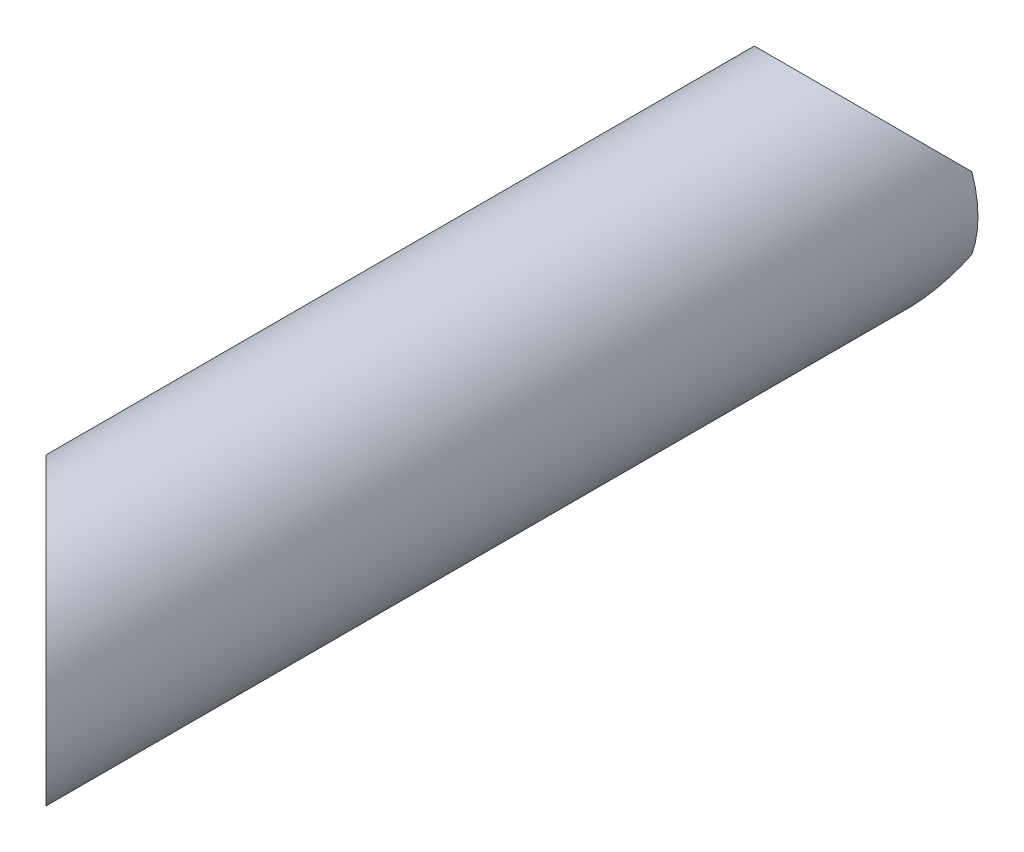
ISO-10303-21;
HEADER;
FILE_DESCRIPTION(('STEP AP214'),'2;1');
FILE_NAME('part.step','',(''),(''),'','','');
FILE_SCHEMA(('AUTOMOTIVE_DESIGN { 1 0 10303 214 1 1 1 1 }'));
ENDSEC;
DATA;
#1=APPLICATION_CONTEXT('core data for automotive mechanical design processes');
#2=APPLICATION_PROTOCOL_DEFINITION('international standard','automotive_design',2000,#1);
#3=PRODUCT_CONTEXT('',#1,'mechanical');
#4=PRODUCT('Part','Part','',(#3));
#5=PRODUCT_RELATED_PRODUCT_CATEGORY('part','',(#4));
#6=PRODUCT_DEFINITION_FORMATION('','',#4);
#7=PRODUCT_DEFINITION_CONTEXT('part definition',#1,'design');
#8=PRODUCT_DEFINITION('design','',#6,#7);
#9=PRODUCT_DEFINITION_SHAPE('','',#8);
#10=(LENGTH_UNIT() NAMED_UNIT(*) SI_UNIT(.MILLI.,.METRE.));
#11=(NAMED_UNIT(*) PLANE_ANGLE_UNIT() SI_UNIT($,.RADIAN.));
#12=(NAMED_UNIT(*) SI_UNIT($,.STERADIAN.) SOLID_ANGLE_UNIT());
#13=UNCERTAINTY_MEASURE_WITH_UNIT(LENGTH_MEASURE(1.E-05),#10,'distance_accuracy_value','');
#14=(GEOMETRIC_REPRESENTATION_CONTEXT(3) GLOBAL_UNCERTAINTY_ASSIGNED_CONTEXT((#13)) GLOBAL_UNIT_ASSIGNED_CONTEXT((#10,
#11,#12)) REPRESENTATION_CONTEXT('',''));
#15=CARTESIAN_POINT('',(0.,0.,0.));
#16=DIRECTION('',(0.,0.,1.));
#17=DIRECTION('',(1.,0.,0.));
#18=AXIS2_PLACEMENT_3D('',#15,#16,#17);
#19=CARTESIAN_POINT('',(0.,0.,0.));
#20=DIRECTION('',(0.,0.,1.));
#21=DIRECTION('',(1.,0.,0.));
#22=AXIS2_PLACEMENT_3D('',#19,#20,#21);
#23=CYLINDRICAL_SURFACE('',#22,16.9418);
#24=CARTESIAN_POINT('',(-16.9418,0.,2.36079288928395));
#25=CARTESIAN_POINT('',(-16.9417971911458,0.26204091353557,2.36080220963783));
#26=CARTESIAN_POINT('',(-16.9356999168505,0.52414580531681,2.37268877904648));
#27=CARTESIAN_POINT('',(-16.9115084687074,1.04583304330237,2.41949474543712));
#28=CARTESIAN_POINT('',(-16.8934062218583,1.30541357267499,2.4544296416793));
#29=CARTESIAN_POINT('',(-16.8456934408202,1.82052686027869,2.54537696237387));
#30=CARTESIAN_POINT('',(-16.8160488500434,2.07604528892248,2.60145174602307));
#31=CARTESIAN_POINT('',(-16.745998056192,2.58092330513842,2.73182326173861));
#32=CARTESIAN_POINT('',(-16.705586602921,2.83027982300868,2.80612888222278));
#33=CARTESIAN_POINT('',(-16.5937130134028,3.43617555401542,3.00787884050468));
#34=CARTESIAN_POINT('',(-16.5165432443815,3.7887724808199,3.14398316469817));
#35=CARTESIAN_POINT('',(-16.3429040786453,4.47894007056581,3.43986296991705));
#36=CARTESIAN_POINT('',(-16.2464220519613,4.81650072242727,3.59965392385975));
#37=CARTESIAN_POINT('',(-16.0353519528832,5.47842118478502,3.936379966143));
#38=CARTESIAN_POINT('',(-15.9207079647238,5.80273620412053,4.11336732455479));
#39=CARTESIAN_POINT('',(-15.6745245861669,6.43816364109246,4.47868001881189));
#40=CARTESIAN_POINT('',(-15.5429871440198,6.74927757565824,4.66700404591887));
#41=CARTESIAN_POINT('',(-15.2876265840934,7.30685828978258,5.01792193937438));
#42=CARTESIAN_POINT('',(-15.1663719794524,7.55523589780271,5.17936588077027));
#43=CARTESIAN_POINT('',(-14.9128296233513,8.04412241901906,5.50549313003114));
#44=CARTESIAN_POINT('',(-14.7805406669795,8.28463046888476,5.67017679015756));
#45=CARTESIAN_POINT('',(-14.3671286777155,8.99504328917724,6.16692838824692));
#46=CARTESIAN_POINT('',(-14.0695301372154,9.45368541428674,6.50159952883297));
#47=CARTESIAN_POINT('',(-13.4308460876238,10.3409516657073,7.16768766252836));
#48=CARTESIAN_POINT('',(-13.0898096922269,10.7696088598247,7.49910788245544));
#49=CARTESIAN_POINT('',(-12.3634321570896,11.5962318020435,8.1512444873396));
#50=CARTESIAN_POINT('',(-11.978112208146,11.9942120787523,8.47196589792548));
#51=CARTESIAN_POINT('',(-11.2593970550385,12.6661635149107,9.02145985247217));
#52=CARTESIAN_POINT('',(-10.935395194055,12.9471427198031,9.25398369778406));
#53=CARTESIAN_POINT('',(-10.2611018317362,13.4878126007023,9.70543060253195));
#54=CARTESIAN_POINT('',(-9.91081089326416,13.7475037322491,9.92435395297853));
#55=CARTESIAN_POINT('',(-9.1846650047165,14.2428722848722,10.3449165959115));
#56=CARTESIAN_POINT('',(-8.80884614161041,14.478582474584,10.5465794124531));
#57=CARTESIAN_POINT('',(-8.03193806600333,14.9235660231237,10.9294061229993));
#58=CARTESIAN_POINT('',(-7.63085417304014,15.1328449193458,11.1105743098261));
#59=CARTESIAN_POINT('',(-6.88424089124478,15.4844385053569,11.4162527833926));
#60=CARTESIAN_POINT('',(-6.54284403089761,15.6318936341838,11.5449610386524));
#61=CARTESIAN_POINT('',(-5.84570886625829,15.9057363671377,11.784662289129));
#62=CARTESIAN_POINT('',(-5.48997359385822,16.032128396386,11.8956590051333));
#63=CARTESIAN_POINT('',(-4.76587416761644,16.2620806160088,12.0980405457268));
#64=CARTESIAN_POINT('',(-4.39751434780836,16.3656485529909,12.1894320241481));
#65=CARTESIAN_POINT('',(-3.6501806384923,16.5483751203216,12.3509305601154));
#66=CARTESIAN_POINT('',(-3.27120663305584,16.6275334839545,12.4210373850906));
#67=CARTESIAN_POINT('',(-2.50306283649956,16.7604309019338,12.5388592799935));
#68=CARTESIAN_POINT('',(-2.11384682454893,16.8140206139527,12.5864427823939));
#69=CARTESIAN_POINT('',(-1.33043651524921,16.8940683445639,12.6575542695153));
#70=CARTESIAN_POINT('',(-0.936242206133039,16.9205262990132,12.6810821973657));
#71=CARTESIAN_POINT('',(-0.146351657649312,16.9457746431554,12.7035339953933));
#72=CARTESIAN_POINT('',(0.249344237347094,16.9445710336468,12.7024632019269));
#73=CARTESIAN_POINT('',(1.0388322594317,16.9145333590508,12.6757536853661));
#74=CARTESIAN_POINT('',(1.43262450172306,16.8857009875526,12.6501164681452));
#75=CARTESIAN_POINT('',(2.17890507129043,16.8048986379041,12.5783444786709));
#76=CARTESIAN_POINT('',(2.53185856185201,16.7553029437224,12.5343138817473));
#77=CARTESIAN_POINT('',(3.23111656907472,16.6346126986087,12.4273127114054));
#78=CARTESIAN_POINT('',(3.57742158136404,16.5635197569156,12.3643435556898));
#79=CARTESIAN_POINT('',(4.26143347844043,16.4008655751894,12.2205374468782));
#80=CARTESIAN_POINT('',(4.59913909094893,16.3093013258068,12.1396978667909));
#81=CARTESIAN_POINT('',(5.26424034287992,16.1069306437966,11.9614399708803));
#82=CARTESIAN_POINT('',(5.5916353501934,15.9961230341249,11.8640206409433));
#83=CARTESIAN_POINT('',(6.25437284564077,15.749284134219,11.6476144331405));
#84=CARTESIAN_POINT('',(6.58898404947681,15.6121273044709,11.5276750855891));
#85=CARTESIAN_POINT('',(7.24389165983872,15.3192467123988,11.2724875846212));
#86=CARTESIAN_POINT('',(7.56418789625109,15.1635227295106,11.1372392493461));
#87=CARTESIAN_POINT('',(8.18964667081063,14.8350613269676,10.8532017457457));
#88=CARTESIAN_POINT('',(8.49480977311718,14.6623245422638,10.7044130827875));
#89=CARTESIAN_POINT('',(9.08954246663263,14.3012544024319,10.3950034259261));
#90=CARTESIAN_POINT('',(9.37910877117766,14.1129177810549,10.2343799548663));
#91=CARTESIAN_POINT('',(10.0895466129533,13.6197686245233,9.81635365564204));
#92=CARTESIAN_POINT('',(10.4999699239497,13.3055153430768,9.5522355714893));
#93=CARTESIAN_POINT('',(11.2837660694822,12.6476577830249,9.00602487775416));
#94=CARTESIAN_POINT('',(11.6571217129248,12.3040400220714,8.72392402686635));
#95=CARTESIAN_POINT('',(12.3684863350005,11.5888148015462,8.1459958455769));
#96=CARTESIAN_POINT('',(12.7063375934006,11.2170941024113,7.8501150517293));
#97=CARTESIAN_POINT('',(13.3452830138175,10.4488102795931,7.25137886128703));
#98=CARTESIAN_POINT('',(13.646385976277,10.052253138272,6.94852515528969));
#99=CARTESIAN_POINT('',(14.2190619891668,9.22507297591768,6.33467912707451));
#100=CARTESIAN_POINT('',(14.4897644436672,8.79386477498994,6.02366425847173));
#101=CARTESIAN_POINT('',(14.9934308742822,7.90462447421647,5.40828952423245));
#102=CARTESIAN_POINT('',(15.226365867375,7.44657213753309,5.10393492321382));
#103=CARTESIAN_POINT('',(15.5459595526586,6.73900064006349,4.66175243381392));
#104=CARTESIAN_POINT('',(15.6473187234659,6.50031397632326,4.51707381171151));
#105=CARTESIAN_POINT('',(15.8401344480737,6.01522203867183,4.23404020981741));
#106=CARTESIAN_POINT('',(15.9315897805553,5.76881581762191,4.09568601115227));
#107=CARTESIAN_POINT('',(16.1040531347265,5.26820969426008,3.82778564223786));
#108=CARTESIAN_POINT('',(16.1850772950492,5.01402260317338,3.69822601591079));
#109=CARTESIAN_POINT('',(16.3362617366941,4.49706863627323,3.45051468996504));
#110=CARTESIAN_POINT('',(16.4064263410483,4.23430522527194,3.33235845790805));
#111=CARTESIAN_POINT('',(16.5271854049167,3.73292327526461,3.12455841756216));
#112=CARTESIAN_POINT('',(16.5791274802116,3.49534666800133,3.03319575633321));
#113=CARTESIAN_POINT('',(16.6734741613925,3.01332700830731,2.86450528665485));
#114=CARTESIAN_POINT('',(16.7158781155854,2.76888348797682,2.78717843727338));
#115=CARTESIAN_POINT('',(16.7902580484617,2.2746459691953,2.64976836532871));
#116=CARTESIAN_POINT('',(16.8222744671779,2.02487685497413,2.58961838337388));
#117=CARTESIAN_POINT('',(16.8753484448806,1.52033952304986,2.48902639390956));
#118=CARTESIAN_POINT('',(16.8964136111092,1.26557490345409,2.44857070708562));
#119=CARTESIAN_POINT('',(16.9216952324195,0.841979784966364,2.39981017970283));
#120=CARTESIAN_POINT('',(16.929222813763,0.674049520852119,2.38521828913398));
#121=CARTESIAN_POINT('',(16.9392769265708,0.337421835790418,2.36570504852651));
#122=CARTESIAN_POINT('',(16.9418018085787,0.168724180192997,2.36078688804909));
#123=CARTESIAN_POINT('',(16.9417971911458,-0.262040913535569,2.36080220963783));
#124=CARTESIAN_POINT('',(16.9356999168505,-0.524145805316808,2.37268877904649));
#125=CARTESIAN_POINT('',(16.9115084687074,-1.04583304330237,2.41949474543712));
#126=CARTESIAN_POINT('',(16.8934062218583,-1.30541357267499,2.45442964167929));
#127=CARTESIAN_POINT('',(16.8456934408202,-1.8205268602787,2.54537696237387));
#128=CARTESIAN_POINT('',(16.8160488500434,-2.07604528892248,2.60145174602307));
#129=CARTESIAN_POINT('',(16.745998056192,-2.58092330513842,2.73182326173861));
#130=CARTESIAN_POINT('',(16.705586602921,-2.83027982300868,2.80612888222278));
#131=CARTESIAN_POINT('',(16.5937130134028,-3.43617555401542,3.00787884050468));
#132=CARTESIAN_POINT('',(16.5165432443815,-3.7887724808199,3.14398316469817));
#133=CARTESIAN_POINT('',(16.3429040786453,-4.47894007056582,3.43986296991705));
#134=CARTESIAN_POINT('',(16.2464220519613,-4.81650072242727,3.59965392385976));
#135=CARTESIAN_POINT('',(16.0353519528832,-5.47842118478502,3.936379966143));
#136=CARTESIAN_POINT('',(15.9207079647238,-5.80273620412053,4.11336732455479));
#137=CARTESIAN_POINT('',(15.6745245861669,-6.43816364109246,4.47868001881189));
#138=CARTESIAN_POINT('',(15.5429871440198,-6.74927757565824,4.66700404591888));
#139=CARTESIAN_POINT('',(15.2876265840934,-7.30685828978258,5.01792193937438));
#140=CARTESIAN_POINT('',(15.1663719794524,-7.55523589780271,5.17936588077027));
#141=CARTESIAN_POINT('',(14.9128296233513,-8.04412241901907,5.50549313003114));
#142=CARTESIAN_POINT('',(14.7805406669795,-8.28463046888476,5.67017679015755));
#143=CARTESIAN_POINT('',(14.3671286777155,-8.99504328917724,6.16692838824692));
#144=CARTESIAN_POINT('',(14.0695301372154,-9.45368541428674,6.50159952883297));
#145=CARTESIAN_POINT('',(13.4308460876238,-10.3409516657073,7.16768766252836));
#146=CARTESIAN_POINT('',(13.0898096922269,-10.7696088598247,7.49910788245544));
#147=CARTESIAN_POINT('',(12.3634321570896,-11.5962318020435,8.1512444873396));
#148=CARTESIAN_POINT('',(11.978112208146,-11.9942120787523,8.47196589792549));
#149=CARTESIAN_POINT('',(11.2593970550385,-12.6661635149107,9.02145985247217));
#150=CARTESIAN_POINT('',(10.935395194055,-12.9471427198031,9.25398369778405));
#151=CARTESIAN_POINT('',(10.2611018317362,-13.4878126007023,9.70543060253195));
#152=CARTESIAN_POINT('',(9.91081089326416,-13.7475037322491,9.92435395297853));
#153=CARTESIAN_POINT('',(9.1846650047165,-14.2428722848722,10.3449165959115));
#154=CARTESIAN_POINT('',(8.80884614161041,-14.478582474584,10.5465794124531));
#155=CARTESIAN_POINT('',(8.03193806600332,-14.9235660231237,10.9294061229993));
#156=CARTESIAN_POINT('',(7.63085417304014,-15.1328449193458,11.1105743098261));
#157=CARTESIAN_POINT('',(6.88424089124478,-15.4844385053568,11.4162527833927));
#158=CARTESIAN_POINT('',(6.54284403089761,-15.6318936341838,11.5449610386524));
#159=CARTESIAN_POINT('',(5.84570886625829,-15.9057363671377,11.784662289129));
#160=CARTESIAN_POINT('',(5.48997359385822,-16.032128396386,11.8956590051333));
#161=CARTESIAN_POINT('',(4.76587416761644,-16.2620806160088,12.0980405457268));
#162=CARTESIAN_POINT('',(4.39751434780836,-16.3656485529909,12.1894320241481));
#163=CARTESIAN_POINT('',(3.6501806384923,-16.5483751203216,12.3509305601154));
#164=CARTESIAN_POINT('',(3.27120663305584,-16.6275334839545,12.4210373850906));
#165=CARTESIAN_POINT('',(2.50306283649956,-16.7604309019338,12.5388592799935));
#166=CARTESIAN_POINT('',(2.11384682454892,-16.8140206139527,12.5864427823939));
#167=CARTESIAN_POINT('',(1.33043651524921,-16.8940683445639,12.6575542695153));
#168=CARTESIAN_POINT('',(0.936242206133032,-16.9205262990132,12.6810821973657));
#169=CARTESIAN_POINT('',(0.146351657649307,-16.9457746431554,12.7035339953933));
#170=CARTESIAN_POINT('',(-0.249344237347095,-16.9445710336468,12.7024632019269));
#171=CARTESIAN_POINT('',(-1.0388322594317,-16.9145333590508,12.6757536853661));
#172=CARTESIAN_POINT('',(-1.43262450172306,-16.8857009875526,12.6501164681452));
#173=CARTESIAN_POINT('',(-2.17890507129043,-16.8048986379041,12.5783444786709));
#174=CARTESIAN_POINT('',(-2.53185856185201,-16.7553029437224,12.5343138817473));
#175=CARTESIAN_POINT('',(-3.23111656907472,-16.6346126986087,12.4273127114054));
#176=CARTESIAN_POINT('',(-3.57742158136404,-16.5635197569156,12.3643435556898));
#177=CARTESIAN_POINT('',(-4.26143347844043,-16.4008655751894,12.2205374468782));
#178=CARTESIAN_POINT('',(-4.59913909094893,-16.3093013258068,12.1396978667909));
#179=CARTESIAN_POINT('',(-5.26424034287991,-16.1069306437967,11.9614399708803));
#180=CARTESIAN_POINT('',(-5.5916353501934,-15.9961230341249,11.8640206409433));
#181=CARTESIAN_POINT('',(-6.25437284564077,-15.749284134219,11.6476144331405));
#182=CARTESIAN_POINT('',(-6.58898404947681,-15.6121273044709,11.5276750855891));
#183=CARTESIAN_POINT('',(-7.24389165983871,-15.3192467123988,11.2724875846212));
#184=CARTESIAN_POINT('',(-7.56418789625108,-15.1635227295106,11.1372392493461));
#185=CARTESIAN_POINT('',(-8.18964667081062,-14.8350613269676,10.8532017457457));
#186=CARTESIAN_POINT('',(-8.49480977311717,-14.6623245422638,10.7044130827875));
#187=CARTESIAN_POINT('',(-9.08954246663262,-14.3012544024319,10.3950034259261));
#188=CARTESIAN_POINT('',(-9.37910877117766,-14.1129177810549,10.2343799548663));
#189=CARTESIAN_POINT('',(-10.0895466129533,-13.6197686245233,9.81635365564204));
#190=CARTESIAN_POINT('',(-10.4999699239497,-13.3055153430767,9.5522355714893));
#191=CARTESIAN_POINT('',(-11.2837660694822,-12.6476577830249,9.00602487775415));
#192=CARTESIAN_POINT('',(-11.6571217129248,-12.3040400220714,8.72392402686635));
#193=CARTESIAN_POINT('',(-12.3684863350005,-11.5888148015462,8.14599584557691));
#194=CARTESIAN_POINT('',(-12.7063375934006,-11.2170941024113,7.85011505172931));
#195=CARTESIAN_POINT('',(-13.3452830138175,-10.4488102795931,7.25137886128704));
#196=CARTESIAN_POINT('',(-13.646385976277,-10.052253138272,6.94852515528969));
#197=CARTESIAN_POINT('',(-14.2190619891668,-9.22507297591769,6.33467912707451));
#198=CARTESIAN_POINT('',(-14.4897644436672,-8.79386477498994,6.02366425847173));
#199=CARTESIAN_POINT('',(-14.9934308742822,-7.90462447421647,5.40828952423245));
#200=CARTESIAN_POINT('',(-15.226365867375,-7.44657213753309,5.10393492321382));
#201=CARTESIAN_POINT('',(-15.5459595526586,-6.7390006400635,4.66175243381392));
#202=CARTESIAN_POINT('',(-15.6473187234659,-6.50031397632327,4.51707381171151));
#203=CARTESIAN_POINT('',(-15.8401344480737,-6.01522203867184,4.23404020981741));
#204=CARTESIAN_POINT('',(-15.9315897805553,-5.76881581762192,4.09568601115228));
#205=CARTESIAN_POINT('',(-16.1040531347265,-5.26820969426009,3.82778564223786));
#206=CARTESIAN_POINT('',(-16.1850772950492,-5.01402260317339,3.69822601591079));
#207=CARTESIAN_POINT('',(-16.3362617366941,-4.49706863627323,3.45051468996504));
#208=CARTESIAN_POINT('',(-16.4064263410483,-4.23430522527194,3.33235845790806));
#209=CARTESIAN_POINT('',(-16.5271854049167,-3.73292327526462,3.12455841756216));
#210=CARTESIAN_POINT('',(-16.5791274802116,-3.49534666800133,3.03319575633322));
#211=CARTESIAN_POINT('',(-16.6734741613925,-3.01332700830732,2.86450528665485));
#212=CARTESIAN_POINT('',(-16.7158781155854,-2.76888348797683,2.78717843727339));
#213=CARTESIAN_POINT('',(-16.7902580484617,-2.2746459691953,2.64976836532871));
#214=CARTESIAN_POINT('',(-16.8222744671779,-2.02487685497414,2.58961838337388));
#215=CARTESIAN_POINT('',(-16.8753484448806,-1.52033952304987,2.48902639390956));
#216=CARTESIAN_POINT('',(-16.8964136111092,-1.2655749034541,2.44857070708561));
#217=CARTESIAN_POINT('',(-16.9216952324195,-0.841979784966366,2.39981017970283));
#218=CARTESIAN_POINT('',(-16.929222813763,-0.674049520852124,2.38521828913398));
#219=CARTESIAN_POINT('',(-16.9392769265708,-0.337421835790422,2.36570504852651));
#220=CARTESIAN_POINT('',(-16.9418018085787,-0.168724180192999,2.36078688804909));
#221=CARTESIAN_POINT('',(-16.9418,0.,2.36079288928395));
#222=B_SPLINE_CURVE_WITH_KNOTS('',3,(#24,#25,#26,#27,#28,#29,#30,#31,#32,#33,#34,#35,#36,#37,
#38,#39,#40,#41,#42,#43,#44,#45,#46,#47,#48,#49,#50,#51,#52,#53,#54,#55,#56,#57,#58,#59,#60,#61,
#62,#63,#64,#65,#66,#67,#68,#69,#70,#71,#72,#73,#74,#75,#76,#77,#78,#79,#80,#81,#82,#83,#84,#85,
#86,#87,#88,#89,#90,#91,#92,#93,#94,#95,#96,#97,#98,#99,#100,#101,#102,#103,#104,#105,#106,#107,
#108,#109,#110,#111,#112,#113,#114,#115,#116,#117,#118,#119,#120,#121,#122,#123,#124,#125,#126,
#127,#128,#129,#130,#131,#132,#133,#134,#135,#136,#137,#138,#139,#140,#141,#142,#143,#144,#145,
#146,#147,#148,#149,#150,#151,#152,#153,#154,#155,#156,#157,#158,#159,#160,#161,#162,#163,#164,
#165,#166,#167,#168,#169,#170,#171,#172,#173,#174,#175,#176,#177,#178,#179,#180,#181,#182,#183,
#184,#185,#186,#187,#188,#189,#190,#191,#192,#193,#194,#195,#196,#197,#198,#199,#200,#201,#202,
#203,#204,#205,#206,#207,#208,#209,#210,#211,#212,#213,#214,#215,#216,#217,#218,#219,#220,#221),
.UNSPECIFIED.,.T.,.F.,(4,2,2,2,2,2,2,2,2,2,2,2,2,2,2,2,2,2,2,2,2,2,2,2,2,2,2,2,2,2,2,2,2,2,2,2,
2,2,2,2,2,2,2,2,2,2,2,2,2,2,2,2,2,2,2,2,2,2,2,2,2,2,2,2,2,2,2,2,2,2,2,2,2,2,2,2,2,2,2,2,2,2,2,2,
2,2,2,2,2,2,2,2,2,2,2,2,2,2,4),(0.,0.785905216636042,1.57233946873147,2.36111195888556,
3.15026978078247,4.30553072579208,5.46154967978709,6.62119946181709,7.78071562625266,
8.74067231468674,9.70073396454543,11.6214342837775,13.5399818969201,15.4576152295693,
16.9199420710519,18.3822376122586,19.8425073849547,21.3024707197488,22.4819219699494,
23.6611251174077,24.8399274190822,26.0187426006992,27.2043612246935,28.3899826516328,
29.5753468766289,30.760638445769,31.83681706094,32.9129151355727,33.9891715042971,
35.0654937267882,36.2073990190237,37.3493178776106,38.4911941337015,39.6333100798602,
41.3721936053643,43.1118798525903,44.8589937753713,46.6056884767512,48.3938440477164,
50.1833654328469,51.0739413625807,51.9646269913632,52.8539175938444,53.7428532669846,
54.521655341778,55.3005106121526,56.0762962613198,56.8515422917167,57.3574080089923,
57.8634404891772,58.6493457058133,59.4357799579087,60.2245524480628,61.0137102699597,
62.1689712149693,63.3249901689643,64.4846399509943,65.6441561154299,66.604112803864,
67.5641744537227,69.4848747729547,71.4034223860973,73.3210557187465,74.7833825602292,
76.2456781014358,77.705947874132,79.165911208926,80.3453624591266,81.5245656065849,
82.7033679082595,83.8821830898764,85.0678017138707,86.25342314081,87.4387873658061,
88.6240789349462,89.7002575501172,90.77635562475,91.8526119934743,92.9289342159654,
94.070839508201,95.2127583667879,96.3546346228787,97.4967505690374,99.2356340945416,
100.975320341768,102.722434264549,104.469128965928,106.257284536894,108.046805922024,
108.937381851758,109.82806748054,110.717358083022,111.606293756162,112.385095830955,
113.16395110133,113.939736750497,114.714982780894,115.22084849817,115.726880978354),.UNSPECIFIED.);
#223=CARTESIAN_POINT('',(-16.9418,0.,2.36079288928395));
#224=VERTEX_POINT('',#223);
#225=EDGE_CURVE('E21',#224,#224,#222,.T.);
#226=ORIENTED_EDGE('',*,*,#225,.T.);
#227=EDGE_LOOP('',(#226));
#228=FACE_BOUND('',#227,.T.);
#229=CARTESIAN_POINT('',(0.,0.,146.05));
#230=DIRECTION('',(0.707106781186548,0.,-0.707106781186548));
#231=DIRECTION('',(0.707106781186548,0.,0.707106781186548));
#232=AXIS2_PLACEMENT_3D('',#229,#230,#231);
#233=ELLIPSE('',#232,23.9593233310125,16.9418);
#234=CARTESIAN_POINT('',(16.9418,0.,162.9918));
#235=VERTEX_POINT('',#234);
#236=EDGE_CURVE('E63',#235,#235,#233,.F.);
#237=ORIENTED_EDGE('',*,*,#236,.T.);
#238=EDGE_LOOP('',(#237));
#239=FACE_BOUND('',#238,.T.);
#240=ADVANCED_FACE('F17',(#228,#239),#23,.F.);
#241=CARTESIAN_POINT('',(0.,0.,0.));
#242=DIRECTION('',(0.,0.,1.));
#243=DIRECTION('',(1.,0.,0.));
#244=AXIS2_PLACEMENT_3D('',#241,#242,#243);
#245=PLANE('',#244);
#246=CARTESIAN_POINT('',(0.,0.,0.));
#247=DIRECTION('',(0.,0.,1.));
#248=DIRECTION('',(1.,0.,0.));
#249=AXIS2_PLACEMENT_3D('',#246,#247,#248);
#250=CIRCLE('',#249,19.05);
#251=CARTESIAN_POINT('',(-17.9605122421382,6.35000000000019,1.88434337577981E-13));
#252=VERTEX_POINT('',#251);
#253=CARTESIAN_POINT('',(-17.9605122421382,-6.35000000000019,1.88434337577981E-13));
#254=VERTEX_POINT('',#253);
#255=EDGE_CURVE('E47',#252,#254,#250,.T.);
#256=ORIENTED_EDGE('',*,*,#255,.F.);
#257=DIRECTION('',(0.,1.,0.));
#258=VECTOR('',#257,1.);
#259=CARTESIAN_POINT('',(-17.9605122421382,-22.4663,3.76434994286967E-13));
#260=LINE('',#259,#258);
#261=EDGE_CURVE('E62',#252,#254,#260,.F.);
#262=ORIENTED_EDGE('',*,*,#261,.T.);
#263=EDGE_LOOP('',(#256,#262));
#264=FACE_BOUND('',#263,.T.);
#265=ADVANCED_FACE('F75',(#264),#245,.F.);
#266=CARTESIAN_POINT('',(0.,-22.4663,-6.35));
#267=DIRECTION('',(0.,1.,0.));
#268=DIRECTION('',(0.,0.,1.));
#269=AXIS2_PLACEMENT_3D('',#266,#267,#268);
#270=CYLINDRICAL_SURFACE('',#269,19.05);
#271=ORIENTED_EDGE('',*,*,#225,.F.);
#272=EDGE_LOOP('',(#271));
#273=FACE_BOUND('',#272,.T.);
#274=DIRECTION('',(0.,1.,0.));
#275=VECTOR('',#274,1.);
#276=CARTESIAN_POINT('',(17.9605122421371,0.,0.));
#277=LINE('',#276,#275);
#278=CARTESIAN_POINT('',(17.9605122421377,6.3500000000017,0.));
#279=VERTEX_POINT('',#278);
#280=CARTESIAN_POINT('',(17.9605122421377,-6.3500000000017,0.));
#281=VERTEX_POINT('',#280);
#282=EDGE_CURVE('E39',#279,#281,#277,.F.);
#283=ORIENTED_EDGE('',*,*,#282,.T.);
#284=CARTESIAN_POINT('',(0.,0.,-6.35));
#285=DIRECTION('',(0.,0.707106781186547,0.707106781186547));
#286=DIRECTION('',(0.,0.707106781186547,-0.707106781186547));
#287=AXIS2_PLACEMENT_3D('',#284,#285,#286);
#288=ELLIPSE('',#287,26.9407683632075,19.05);
#289=EDGE_CURVE('E56',#254,#281,#288,.T.);
#290=ORIENTED_EDGE('',*,*,#289,.F.);
#291=ORIENTED_EDGE('',*,*,#261,.F.);
#292=CARTESIAN_POINT('',(0.,0.,-6.35));
#293=DIRECTION('',(0.,0.707106781186547,-0.707106781186547));
#294=DIRECTION('',(0.,0.707106781186547,0.707106781186547));
#295=AXIS2_PLACEMENT_3D('',#292,#293,#294);
#296=ELLIPSE('',#295,26.9407683632075,19.05);
#297=EDGE_CURVE('E55',#279,#252,#296,.F.);
#298=ORIENTED_EDGE('',*,*,#297,.F.);
#299=EDGE_LOOP('',(#283,#290,#291,#298));
#300=FACE_BOUND('',#299,.T.);
#301=ADVANCED_FACE('F61',(#273,#300),#270,.F.);
#302=CARTESIAN_POINT('',(0.,0.,0.));
#303=DIRECTION('',(0.,0.,1.));
#304=DIRECTION('',(1.,0.,0.));
#305=AXIS2_PLACEMENT_3D('',#302,#303,#304);
#306=PLANE('',#305);
#307=CARTESIAN_POINT('',(0.,0.,0.));
#308=DIRECTION('',(0.,0.,1.));
#309=DIRECTION('',(1.,0.,0.));
#310=AXIS2_PLACEMENT_3D('',#307,#308,#309);
#311=CIRCLE('',#310,19.05);
#312=EDGE_CURVE('E30',#281,#279,#311,.T.);
#313=ORIENTED_EDGE('',*,*,#312,.F.);
#314=ORIENTED_EDGE('',*,*,#282,.F.);
#315=EDGE_LOOP('',(#313,#314));
#316=FACE_BOUND('',#315,.T.);
#317=ADVANCED_FACE('F59',(#316),#306,.F.);
#318=CARTESIAN_POINT('',(19.05,-21.7043,165.1));
#319=DIRECTION('',(0.707106781186548,0.,-0.707106781186548));
#320=DIRECTION('',(-0.707106781186548,0.,-0.707106781186548));
#321=AXIS2_PLACEMENT_3D('',#318,#319,#320);
#322=PLANE('',#321);
#323=ORIENTED_EDGE('',*,*,#236,.F.);
#324=EDGE_LOOP('',(#323));
#325=FACE_BOUND('',#324,.T.);
#326=CARTESIAN_POINT('',(0.,0.,146.05));
#327=DIRECTION('',(0.707106781186548,0.,-0.707106781186548));
#328=DIRECTION('',(0.707106781186548,0.,0.707106781186548));
#329=AXIS2_PLACEMENT_3D('',#326,#327,#328);
#330=ELLIPSE('',#329,26.9407683632075,19.05);
#331=CARTESIAN_POINT('',(19.05,0.,165.1));
#332=VERTEX_POINT('',#331);
#333=EDGE_CURVE('E11',#332,#332,#330,.T.);
#334=ORIENTED_EDGE('',*,*,#333,.F.);
#335=EDGE_LOOP('',(#334));
#336=FACE_BOUND('',#335,.T.);
#337=ADVANCED_FACE('F81',(#325,#336),#322,.F.);
#338=CARTESIAN_POINT('',(0.,0.,0.));
#339=DIRECTION('',(0.,0.,1.));
#340=DIRECTION('',(1.,0.,0.));
#341=AXIS2_PLACEMENT_3D('',#338,#339,#340);
#342=CYLINDRICAL_SURFACE('',#341,19.05);
#343=ORIENTED_EDGE('',*,*,#297,.T.);
#344=ORIENTED_EDGE('',*,*,#255,.T.);
#345=ORIENTED_EDGE('',*,*,#289,.T.);
#346=ORIENTED_EDGE('',*,*,#312,.T.);
#347=EDGE_LOOP('',(#343,#344,#345,#346));
#348=FACE_BOUND('',#347,.T.);
#349=ORIENTED_EDGE('',*,*,#333,.T.);
#350=EDGE_LOOP('',(#349));
#351=FACE_BOUND('',#350,.T.);
#352=ADVANCED_FACE('F53',(#348,#351),#342,.T.);
#353=CLOSED_SHELL('',(#240,#265,#301,#317,#337,#352));
#354=MANIFOLD_SOLID_BREP('B1',#353);
#355=ADVANCED_BREP_SHAPE_REPRESENTATION('',(#18,#354),#14);
#356=SHAPE_DEFINITION_REPRESENTATION(#9,#355);
ENDSEC;
END-ISO-10303-21;
